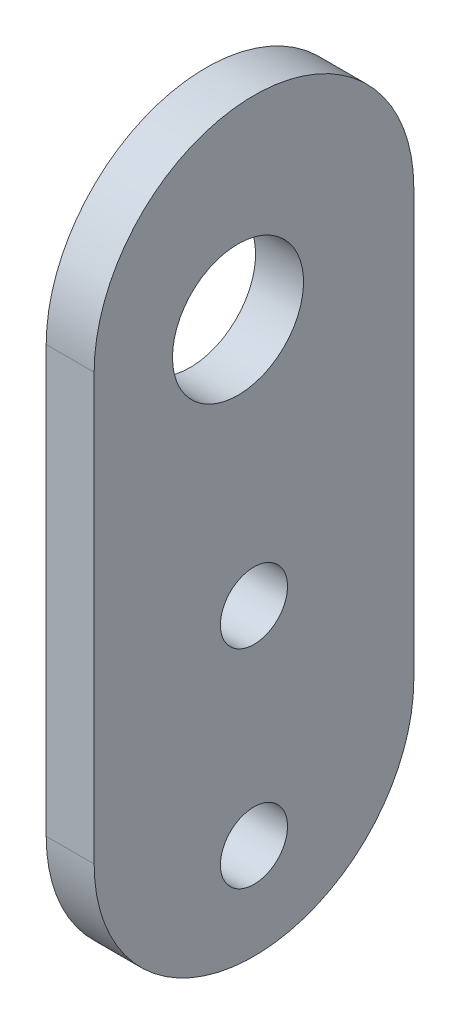
ISO-10303-21;
HEADER;
FILE_DESCRIPTION(('STEP AP214'),'2;1');
FILE_NAME('part.step','',(''),(''),'','','');
FILE_SCHEMA(('AUTOMOTIVE_DESIGN { 1 0 10303 214 1 1 1 1 }'));
ENDSEC;
DATA;
#1=APPLICATION_CONTEXT('core data for automotive mechanical design processes');
#2=APPLICATION_PROTOCOL_DEFINITION('international standard','automotive_design',2000,#1);
#3=PRODUCT_CONTEXT('',#1,'mechanical');
#4=PRODUCT('Part','Part','',(#3));
#5=PRODUCT_RELATED_PRODUCT_CATEGORY('part','',(#4));
#6=PRODUCT_DEFINITION_FORMATION('','',#4);
#7=PRODUCT_DEFINITION_CONTEXT('part definition',#1,'design');
#8=PRODUCT_DEFINITION('design','',#6,#7);
#9=PRODUCT_DEFINITION_SHAPE('','',#8);
#10=(LENGTH_UNIT() NAMED_UNIT(*) SI_UNIT(.MILLI.,.METRE.));
#11=(NAMED_UNIT(*) PLANE_ANGLE_UNIT() SI_UNIT($,.RADIAN.));
#12=(NAMED_UNIT(*) SI_UNIT($,.STERADIAN.) SOLID_ANGLE_UNIT());
#13=UNCERTAINTY_MEASURE_WITH_UNIT(LENGTH_MEASURE(1.E-05),#10,'distance_accuracy_value','');
#14=(GEOMETRIC_REPRESENTATION_CONTEXT(3) GLOBAL_UNCERTAINTY_ASSIGNED_CONTEXT((#13)) GLOBAL_UNIT_ASSIGNED_CONTEXT((#10,
#11,#12)) REPRESENTATION_CONTEXT('',''));
#15=CARTESIAN_POINT('',(0.,0.,0.));
#16=DIRECTION('',(0.,0.,1.));
#17=DIRECTION('',(1.,0.,0.));
#18=AXIS2_PLACEMENT_3D('',#15,#16,#17);
#19=CARTESIAN_POINT('',(-126.55,168.0857476665,139.));
#20=DIRECTION('',(1.,0.,0.));
#21=DIRECTION('',(0.,0.,-1.));
#22=AXIS2_PLACEMENT_3D('',#19,#20,#21);
#23=PLANE('',#22);
#24=CARTESIAN_POINT('',(-126.55,119.0857476665,138.));
#25=DIRECTION('',(-1.,0.,0.));
#26=DIRECTION('',(0.,0.,1.));
#27=AXIS2_PLACEMENT_3D('',#24,#25,#26);
#28=CIRCLE('',#27,2.09999999999999);
#29=CARTESIAN_POINT('',(-126.55,119.0857476665,140.1));
#30=VERTEX_POINT('',#29);
#31=EDGE_CURVE('E94',#30,#30,#28,.F.);
#32=ORIENTED_EDGE('',*,*,#31,.T.);
#33=EDGE_LOOP('',(#32));
#34=FACE_BOUND('',#33,.T.);
#35=CARTESIAN_POINT('',(-126.55,132.0857476665,138.));
#36=DIRECTION('',(-1.,0.,0.));
#37=DIRECTION('',(0.,0.,1.));
#38=AXIS2_PLACEMENT_3D('',#35,#36,#37);
#39=CIRCLE('',#38,2.09999999999999);
#40=CARTESIAN_POINT('',(-126.55,132.0857476665,140.1));
#41=VERTEX_POINT('',#40);
#42=EDGE_CURVE('E97',#41,#41,#39,.F.);
#43=ORIENTED_EDGE('',*,*,#42,.T.);
#44=EDGE_LOOP('',(#43));
#45=FACE_BOUND('',#44,.T.);
#46=CARTESIAN_POINT('',(-126.55,148.0857476665,139.));
#47=DIRECTION('',(-1.,0.,0.));
#48=DIRECTION('',(0.,0.,1.));
#49=AXIS2_PLACEMENT_3D('',#46,#47,#48);
#50=CIRCLE('',#49,4.09999999999999);
#51=CARTESIAN_POINT('',(-126.55,148.0857476665,143.1));
#52=VERTEX_POINT('',#51);
#53=EDGE_CURVE('E70',#52,#52,#50,.F.);
#54=ORIENTED_EDGE('',*,*,#53,.T.);
#55=EDGE_LOOP('',(#54));
#56=FACE_BOUND('',#55,.T.);
#57=DIRECTION('',(0.,1.,0.));
#58=VECTOR('',#57,1.);
#59=CARTESIAN_POINT('',(-126.55,195.9043807818,128.));
#60=LINE('',#59,#58);
#61=CARTESIAN_POINT('',(-126.55,149.7357476665,128.));
#62=VERTEX_POINT('',#61);
#63=CARTESIAN_POINT('',(-126.55,123.0857476665,128.));
#64=VERTEX_POINT('',#63);
#65=EDGE_CURVE('E58',#62,#64,#60,.F.);
#66=ORIENTED_EDGE('',*,*,#65,.T.);
#67=CARTESIAN_POINT('',(-126.55,123.0857476665,138.));
#68=DIRECTION('',(1.,0.,0.));
#69=DIRECTION('',(0.,0.,-1.));
#70=AXIS2_PLACEMENT_3D('',#67,#68,#69);
#71=CIRCLE('',#70,10.);
#72=CARTESIAN_POINT('',(-126.55,123.0857476665,148.));
#73=VERTEX_POINT('',#72);
#74=EDGE_CURVE('E77',#73,#64,#71,.T.);
#75=ORIENTED_EDGE('',*,*,#74,.F.);
#76=DIRECTION('',(0.,1.,0.));
#77=VECTOR('',#76,1.);
#78=CARTESIAN_POINT('',(-126.55,107.4054732291,148.));
#79=LINE('',#78,#77);
#80=CARTESIAN_POINT('',(-126.55,149.7357476665,148.));
#81=VERTEX_POINT('',#80);
#82=EDGE_CURVE('E60',#73,#81,#79,.T.);
#83=ORIENTED_EDGE('',*,*,#82,.T.);
#84=CARTESIAN_POINT('',(-126.55,149.7357476665,138.));
#85=DIRECTION('',(-1.,0.,0.));
#86=DIRECTION('',(0.,0.,1.));
#87=AXIS2_PLACEMENT_3D('',#84,#85,#86);
#88=CIRCLE('',#87,10.);
#89=EDGE_CURVE('E20',#62,#81,#88,.F.);
#90=ORIENTED_EDGE('',*,*,#89,.F.);
#91=EDGE_LOOP('',(#66,#75,#83,#90));
#92=FACE_BOUND('',#91,.T.);
#93=ADVANCED_FACE('F17',(#34,#45,#56,#92),#23,.F.);
#94=CARTESIAN_POINT('',(-117.032,149.7357476665,138.));
#95=DIRECTION('',(-1.,0.,0.));
#96=DIRECTION('',(0.,0.,1.));
#97=AXIS2_PLACEMENT_3D('',#94,#95,#96);
#98=CYLINDRICAL_SURFACE('',#97,10.);
#99=ORIENTED_EDGE('',*,*,#89,.T.);
#100=DIRECTION('',(-1.,0.,0.));
#101=VECTOR('',#100,1.);
#102=CARTESIAN_POINT('',(-123.55,149.7357476665,148.));
#103=LINE('',#102,#101);
#104=CARTESIAN_POINT('',(-123.55,149.7357476665,148.));
#105=VERTEX_POINT('',#104);
#106=EDGE_CURVE('E81',#81,#105,#103,.F.);
#107=ORIENTED_EDGE('',*,*,#106,.T.);
#108=CARTESIAN_POINT('',(-123.55,149.7357476665,138.));
#109=DIRECTION('',(-1.,0.,0.));
#110=DIRECTION('',(0.,0.,1.));
#111=AXIS2_PLACEMENT_3D('',#108,#109,#110);
#112=CIRCLE('',#111,10.);
#113=CARTESIAN_POINT('',(-123.55,149.7357476665,128.));
#114=VERTEX_POINT('',#113);
#115=EDGE_CURVE('E67',#114,#105,#112,.F.);
#116=ORIENTED_EDGE('',*,*,#115,.F.);
#117=DIRECTION('',(1.,0.,0.));
#118=VECTOR('',#117,1.);
#119=CARTESIAN_POINT('',(-123.55,149.7357476665,128.));
#120=LINE('',#119,#118);
#121=EDGE_CURVE('E64',#114,#62,#120,.F.);
#122=ORIENTED_EDGE('',*,*,#121,.T.);
#123=EDGE_LOOP('',(#99,#107,#116,#122));
#124=FACE_BOUND('',#123,.T.);
#125=ADVANCED_FACE('F65',(#124),#98,.T.);
#126=CARTESIAN_POINT('',(-123.55,107.4054732291,148.));
#127=DIRECTION('',(0.,0.,-1.));
#128=DIRECTION('',(-1.,0.,0.));
#129=AXIS2_PLACEMENT_3D('',#126,#127,#128);
#130=PLANE('',#129);
#131=ORIENTED_EDGE('',*,*,#82,.F.);
#132=DIRECTION('',(1.,0.,0.));
#133=VECTOR('',#132,1.);
#134=CARTESIAN_POINT('',(-135.068,123.0857476665,148.));
#135=LINE('',#134,#133);
#136=CARTESIAN_POINT('',(-123.55,123.0857476665,148.));
#137=VERTEX_POINT('',#136);
#138=EDGE_CURVE('E73',#137,#73,#135,.F.);
#139=ORIENTED_EDGE('',*,*,#138,.F.);
#140=DIRECTION('',(0.,1.,0.));
#141=VECTOR('',#140,1.);
#142=CARTESIAN_POINT('',(-123.55,168.0857476665,148.));
#143=LINE('',#142,#141);
#144=EDGE_CURVE('E92',#105,#137,#143,.F.);
#145=ORIENTED_EDGE('',*,*,#144,.F.);
#146=ORIENTED_EDGE('',*,*,#106,.F.);
#147=EDGE_LOOP('',(#131,#139,#145,#146));
#148=FACE_BOUND('',#147,.T.);
#149=ADVANCED_FACE('F104',(#148),#130,.F.);
#150=CARTESIAN_POINT('',(-135.068,123.0857476665,138.));
#151=DIRECTION('',(1.,0.,0.));
#152=DIRECTION('',(0.,0.,-1.));
#153=AXIS2_PLACEMENT_3D('',#150,#151,#152);
#154=CYLINDRICAL_SURFACE('',#153,10.);
#155=CARTESIAN_POINT('',(-123.55,123.0857476665,138.));
#156=DIRECTION('',(1.,0.,0.));
#157=DIRECTION('',(0.,0.,-1.));
#158=AXIS2_PLACEMENT_3D('',#155,#156,#157);
#159=CIRCLE('',#158,10.);
#160=CARTESIAN_POINT('',(-123.55,123.0857476665,128.));
#161=VERTEX_POINT('',#160);
#162=EDGE_CURVE('E89',#137,#161,#159,.T.);
#163=ORIENTED_EDGE('',*,*,#162,.F.);
#164=ORIENTED_EDGE('',*,*,#138,.T.);
#165=ORIENTED_EDGE('',*,*,#74,.T.);
#166=DIRECTION('',(1.,0.,0.));
#167=VECTOR('',#166,1.);
#168=CARTESIAN_POINT('',(-123.55,123.0857476665,128.));
#169=LINE('',#168,#167);
#170=EDGE_CURVE('E35',#64,#161,#169,.T.);
#171=ORIENTED_EDGE('',*,*,#170,.T.);
#172=EDGE_LOOP('',(#163,#164,#165,#171));
#173=FACE_BOUND('',#172,.T.);
#174=ADVANCED_FACE('F109',(#173),#154,.T.);
#175=CARTESIAN_POINT('',(-123.55,195.9043807818,128.));
#176=DIRECTION('',(0.,0.,1.));
#177=DIRECTION('',(1.,0.,0.));
#178=AXIS2_PLACEMENT_3D('',#175,#176,#177);
#179=PLANE('',#178);
#180=DIRECTION('',(0.,1.,0.));
#181=VECTOR('',#180,1.);
#182=CARTESIAN_POINT('',(-123.55,168.0857476665,128.));
#183=LINE('',#182,#181);
#184=EDGE_CURVE('E88',#161,#114,#183,.T.);
#185=ORIENTED_EDGE('',*,*,#184,.F.);
#186=ORIENTED_EDGE('',*,*,#170,.F.);
#187=ORIENTED_EDGE('',*,*,#65,.F.);
#188=ORIENTED_EDGE('',*,*,#121,.F.);
#189=EDGE_LOOP('',(#185,#186,#187,#188));
#190=FACE_BOUND('',#189,.T.);
#191=ADVANCED_FACE('F72',(#190),#179,.F.);
#192=CARTESIAN_POINT('',(-128.55,148.0857476665,139.));
#193=DIRECTION('',(-1.,0.,0.));
#194=DIRECTION('',(0.,0.,1.));
#195=AXIS2_PLACEMENT_3D('',#192,#193,#194);
#196=CYLINDRICAL_SURFACE('',#195,4.09999999999999);
#197=CARTESIAN_POINT('',(-123.55,148.0857476665,139.));
#198=DIRECTION('',(-1.,0.,0.));
#199=DIRECTION('',(0.,0.,1.));
#200=AXIS2_PLACEMENT_3D('',#197,#198,#199);
#201=CIRCLE('',#200,4.09999999999999);
#202=CARTESIAN_POINT('',(-123.55,148.0857476665,143.1));
#203=VERTEX_POINT('',#202);
#204=EDGE_CURVE('E85',#203,#203,#201,.T.);
#205=ORIENTED_EDGE('',*,*,#204,.F.);
#206=EDGE_LOOP('',(#205));
#207=FACE_BOUND('',#206,.T.);
#208=ORIENTED_EDGE('',*,*,#53,.F.);
#209=EDGE_LOOP('',(#208));
#210=FACE_BOUND('',#209,.T.);
#211=ADVANCED_FACE('F117',(#207,#210),#196,.F.);
#212=CARTESIAN_POINT('',(-128.55,132.0857476665,138.));
#213=DIRECTION('',(-1.,0.,0.));
#214=DIRECTION('',(0.,0.,1.));
#215=AXIS2_PLACEMENT_3D('',#212,#213,#214);
#216=CYLINDRICAL_SURFACE('',#215,2.09999999999999);
#217=CARTESIAN_POINT('',(-123.55,132.0857476665,138.));
#218=DIRECTION('',(-1.,0.,0.));
#219=DIRECTION('',(0.,0.,1.));
#220=AXIS2_PLACEMENT_3D('',#217,#218,#219);
#221=CIRCLE('',#220,2.09999999999999);
#222=CARTESIAN_POINT('',(-123.55,132.0857476665,140.1));
#223=VERTEX_POINT('',#222);
#224=EDGE_CURVE('E26',#223,#223,#221,.T.);
#225=ORIENTED_EDGE('',*,*,#224,.F.);
#226=EDGE_LOOP('',(#225));
#227=FACE_BOUND('',#226,.T.);
#228=ORIENTED_EDGE('',*,*,#42,.F.);
#229=EDGE_LOOP('',(#228));
#230=FACE_BOUND('',#229,.T.);
#231=ADVANCED_FACE('F127',(#227,#230),#216,.F.);
#232=CARTESIAN_POINT('',(-128.55,119.0857476665,138.));
#233=DIRECTION('',(-1.,0.,0.));
#234=DIRECTION('',(0.,0.,1.));
#235=AXIS2_PLACEMENT_3D('',#232,#233,#234);
#236=CYLINDRICAL_SURFACE('',#235,2.09999999999999);
#237=CARTESIAN_POINT('',(-123.55,119.0857476665,138.));
#238=DIRECTION('',(-1.,0.,0.));
#239=DIRECTION('',(0.,0.,1.));
#240=AXIS2_PLACEMENT_3D('',#237,#238,#239);
#241=CIRCLE('',#240,2.09999999999999);
#242=CARTESIAN_POINT('',(-123.55,119.0857476665,140.1));
#243=VERTEX_POINT('',#242);
#244=EDGE_CURVE('E11',#243,#243,#241,.T.);
#245=ORIENTED_EDGE('',*,*,#244,.F.);
#246=EDGE_LOOP('',(#245));
#247=FACE_BOUND('',#246,.T.);
#248=ORIENTED_EDGE('',*,*,#31,.F.);
#249=EDGE_LOOP('',(#248));
#250=FACE_BOUND('',#249,.T.);
#251=ADVANCED_FACE('F121',(#247,#250),#236,.F.);
#252=CARTESIAN_POINT('',(-123.55,168.0857476665,139.));
#253=DIRECTION('',(1.,0.,0.));
#254=DIRECTION('',(0.,0.,-1.));
#255=AXIS2_PLACEMENT_3D('',#252,#253,#254);
#256=PLANE('',#255);
#257=ORIENTED_EDGE('',*,*,#244,.T.);
#258=EDGE_LOOP('',(#257));
#259=FACE_BOUND('',#258,.T.);
#260=ORIENTED_EDGE('',*,*,#224,.T.);
#261=EDGE_LOOP('',(#260));
#262=FACE_BOUND('',#261,.T.);
#263=ORIENTED_EDGE('',*,*,#204,.T.);
#264=EDGE_LOOP('',(#263));
#265=FACE_BOUND('',#264,.T.);
#266=ORIENTED_EDGE('',*,*,#162,.T.);
#267=ORIENTED_EDGE('',*,*,#184,.T.);
#268=ORIENTED_EDGE('',*,*,#115,.T.);
#269=ORIENTED_EDGE('',*,*,#144,.T.);
#270=EDGE_LOOP('',(#266,#267,#268,#269));
#271=FACE_BOUND('',#270,.T.);
#272=ADVANCED_FACE('F107',(#259,#262,#265,#271),#256,.T.);
#273=CLOSED_SHELL('',(#93,#125,#149,#174,#191,#211,#231,#251,#272));
#274=MANIFOLD_SOLID_BREP('B1',#273);
#275=ADVANCED_BREP_SHAPE_REPRESENTATION('',(#18,#274),#14);
#276=SHAPE_DEFINITION_REPRESENTATION(#9,#275);
ENDSEC;
END-ISO-10303-21;
